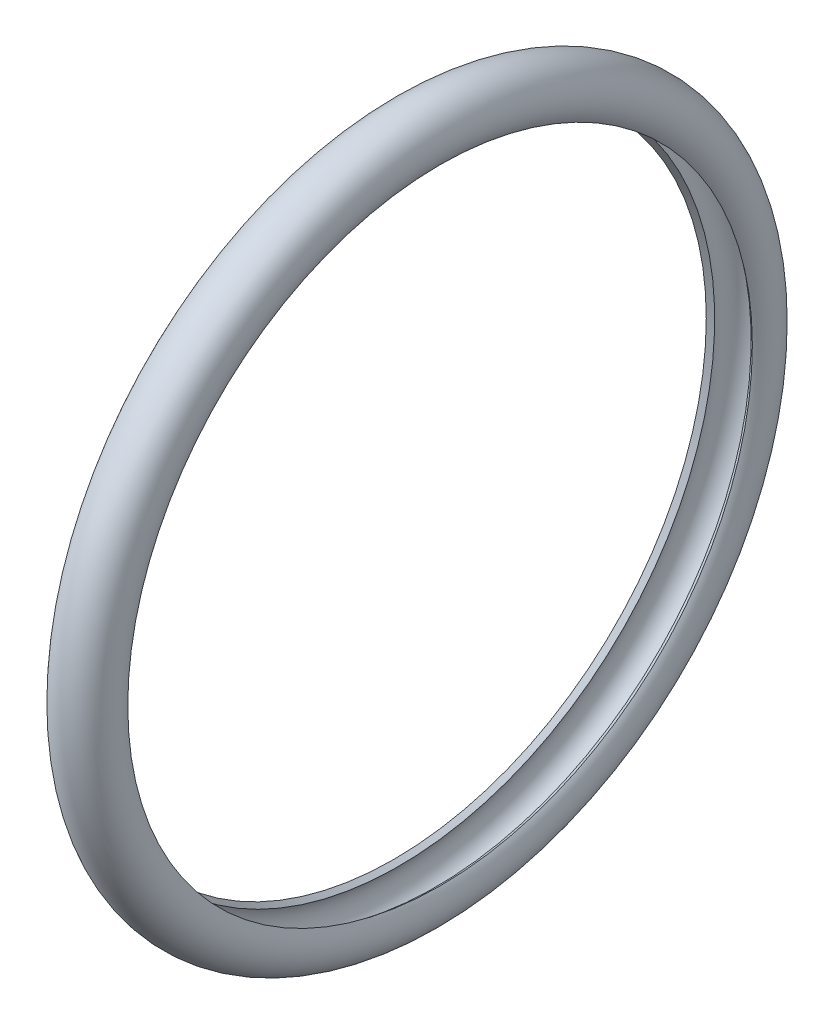
ISO-10303-21;
HEADER;
FILE_DESCRIPTION(('STEP AP214'),'2;1');
FILE_NAME('part.step','',(''),(''),'','','');
FILE_SCHEMA(('AUTOMOTIVE_DESIGN { 1 0 10303 214 1 1 1 1 }'));
ENDSEC;
DATA;
#1=APPLICATION_CONTEXT('core data for automotive mechanical design processes');
#2=APPLICATION_PROTOCOL_DEFINITION('international standard','automotive_design',2000,#1);
#3=PRODUCT_CONTEXT('',#1,'mechanical');
#4=PRODUCT('Part','Part','',(#3));
#5=PRODUCT_RELATED_PRODUCT_CATEGORY('part','',(#4));
#6=PRODUCT_DEFINITION_FORMATION('','',#4);
#7=PRODUCT_DEFINITION_CONTEXT('part definition',#1,'design');
#8=PRODUCT_DEFINITION('design','',#6,#7);
#9=PRODUCT_DEFINITION_SHAPE('','',#8);
#10=(LENGTH_UNIT() NAMED_UNIT(*) SI_UNIT(.MILLI.,.METRE.));
#11=(NAMED_UNIT(*) PLANE_ANGLE_UNIT() SI_UNIT($,.RADIAN.));
#12=(NAMED_UNIT(*) SI_UNIT($,.STERADIAN.) SOLID_ANGLE_UNIT());
#13=UNCERTAINTY_MEASURE_WITH_UNIT(LENGTH_MEASURE(1.E-05),#10,'distance_accuracy_value','');
#14=(GEOMETRIC_REPRESENTATION_CONTEXT(3) GLOBAL_UNCERTAINTY_ASSIGNED_CONTEXT((#13)) GLOBAL_UNIT_ASSIGNED_CONTEXT((#10,
#11,#12)) REPRESENTATION_CONTEXT('',''));
#15=CARTESIAN_POINT('',(0.,0.,0.));
#16=DIRECTION('',(0.,0.,1.));
#17=DIRECTION('',(1.,0.,0.));
#18=AXIS2_PLACEMENT_3D('',#15,#16,#17);
#19=CARTESIAN_POINT('',(2.08722353556157,0.,0.));
#20=DIRECTION('',(-1.,0.,0.));
#21=DIRECTION('',(0.,0.,1.));
#22=AXIS2_PLACEMENT_3D('',#19,#20,#21);
#23=TOROIDAL_SURFACE('',#22,13.685,1.195);
#24=CARTESIAN_POINT('',(1.12972679927471,0.,0.));
#25=DIRECTION('',(-1.,0.,0.));
#26=DIRECTION('',(0.,0.,1.));
#27=AXIS2_PLACEMENT_3D('',#24,#25,#26);
#28=CIRCLE('',#27,12.97);
#29=CARTESIAN_POINT('',(1.12972679927471,0.,12.97));
#30=VERTEX_POINT('',#29);
#31=EDGE_CURVE('E10',#30,#30,#28,.T.);
#32=ORIENTED_EDGE('',*,*,#31,.F.);
#33=EDGE_LOOP('',(#32));
#34=FACE_BOUND('',#33,.T.);
#35=CARTESIAN_POINT('',(3.04472027184843,0.,0.));
#36=DIRECTION('',(-1.,0.,0.));
#37=DIRECTION('',(0.,0.,1.));
#38=AXIS2_PLACEMENT_3D('',#35,#36,#37);
#39=CIRCLE('',#38,12.97);
#40=CARTESIAN_POINT('',(3.04472027184843,0.,12.97));
#41=VERTEX_POINT('',#40);
#42=EDGE_CURVE('E58',#41,#41,#39,.T.);
#43=ORIENTED_EDGE('',*,*,#42,.T.);
#44=EDGE_LOOP('',(#43));
#45=FACE_BOUND('',#44,.T.);
#46=ADVANCED_FACE('F41',(#34,#45),#23,.T.);
#47=CARTESIAN_POINT('',(1.12972679927471,0.,0.));
#48=DIRECTION('',(1.,0.,0.));
#49=DIRECTION('',(0.,0.,-1.));
#50=AXIS2_PLACEMENT_3D('',#47,#48,#49);
#51=CONICAL_SURFACE('',#50,12.97,0.641410695746081);
#52=CARTESIAN_POINT('',(1.33003992402091,0.,0.));
#53=DIRECTION('',(-1.,0.,0.));
#54=DIRECTION('',(0.,0.,1.));
#55=AXIS2_PLACEMENT_3D('',#52,#53,#54);
#56=CIRCLE('',#55,13.1195815899582);
#57=CARTESIAN_POINT('',(1.33003992402091,0.,13.1195815899582));
#58=VERTEX_POINT('',#57);
#59=EDGE_CURVE('E48',#58,#58,#56,.T.);
#60=ORIENTED_EDGE('',*,*,#59,.F.);
#61=EDGE_LOOP('',(#60));
#62=FACE_BOUND('',#61,.T.);
#63=ORIENTED_EDGE('',*,*,#31,.T.);
#64=EDGE_LOOP('',(#63));
#65=FACE_BOUND('',#64,.T.);
#66=ADVANCED_FACE('F74',(#62,#65),#51,.F.);
#67=CARTESIAN_POINT('',(2.08722353556157,0.,0.));
#68=DIRECTION('',(-1.,0.,0.));
#69=DIRECTION('',(0.,0.,1.));
#70=AXIS2_PLACEMENT_3D('',#67,#68,#69);
#71=TOROIDAL_SURFACE('',#70,13.685,0.944999999999999);
#72=CARTESIAN_POINT('',(2.84440714710223,0.,0.));
#73=DIRECTION('',(-1.,0.,0.));
#74=DIRECTION('',(0.,0.,1.));
#75=AXIS2_PLACEMENT_3D('',#72,#73,#74);
#76=CIRCLE('',#75,13.1195815899582);
#77=CARTESIAN_POINT('',(2.84440714710223,0.,13.1195815899582));
#78=VERTEX_POINT('',#77);
#79=EDGE_CURVE('E53',#78,#78,#76,.T.);
#80=ORIENTED_EDGE('',*,*,#79,.F.);
#81=EDGE_LOOP('',(#80));
#82=FACE_BOUND('',#81,.T.);
#83=ORIENTED_EDGE('',*,*,#59,.T.);
#84=EDGE_LOOP('',(#83));
#85=FACE_BOUND('',#84,.T.);
#86=ADVANCED_FACE('F69',(#82,#85),#71,.F.);
#87=CARTESIAN_POINT('',(2.84440714710223,0.,0.));
#88=DIRECTION('',(-1.,0.,0.));
#89=DIRECTION('',(0.,0.,1.));
#90=AXIS2_PLACEMENT_3D('',#87,#88,#89);
#91=CONICAL_SURFACE('',#90,13.1195815899582,0.641410695746048);
#92=ORIENTED_EDGE('',*,*,#42,.F.);
#93=EDGE_LOOP('',(#92));
#94=FACE_BOUND('',#93,.T.);
#95=ORIENTED_EDGE('',*,*,#79,.T.);
#96=EDGE_LOOP('',(#95));
#97=FACE_BOUND('',#96,.T.);
#98=ADVANCED_FACE('F66',(#94,#97),#91,.F.);
#99=CLOSED_SHELL('',(#46,#66,#86,#98));
#100=MANIFOLD_SOLID_BREP('B2',#99);
#101=ADVANCED_BREP_SHAPE_REPRESENTATION('',(#18,#100),#14);
#102=SHAPE_DEFINITION_REPRESENTATION(#9,#101);
ENDSEC;
END-ISO-10303-21;
